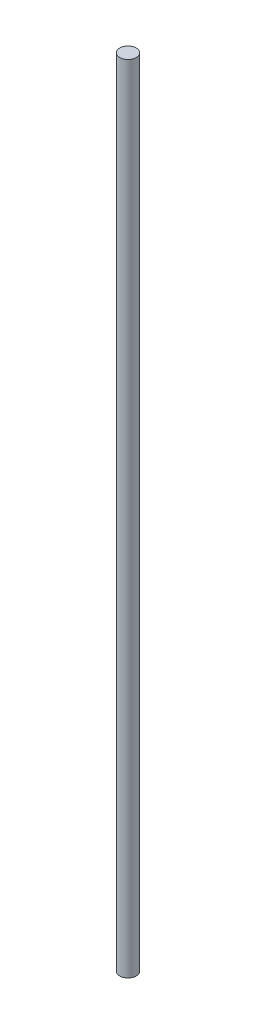
ISO-10303-21;
HEADER;
FILE_DESCRIPTION(('STEP AP214'),'2;1');
FILE_NAME('part.step','',(''),(''),'','','');
FILE_SCHEMA(('AUTOMOTIVE_DESIGN { 1 0 10303 214 1 1 1 1 }'));
ENDSEC;
DATA;
#1=APPLICATION_CONTEXT('core data for automotive mechanical design processes');
#2=APPLICATION_PROTOCOL_DEFINITION('international standard','automotive_design',2000,#1);
#3=PRODUCT_CONTEXT('',#1,'mechanical');
#4=PRODUCT('Part','Part','',(#3));
#5=PRODUCT_RELATED_PRODUCT_CATEGORY('part','',(#4));
#6=PRODUCT_DEFINITION_FORMATION('','',#4);
#7=PRODUCT_DEFINITION_CONTEXT('part definition',#1,'design');
#8=PRODUCT_DEFINITION('design','',#6,#7);
#9=PRODUCT_DEFINITION_SHAPE('','',#8);
#10=(LENGTH_UNIT() NAMED_UNIT(*) SI_UNIT(.MILLI.,.METRE.));
#11=(NAMED_UNIT(*) PLANE_ANGLE_UNIT() SI_UNIT($,.RADIAN.));
#12=(NAMED_UNIT(*) SI_UNIT($,.STERADIAN.) SOLID_ANGLE_UNIT());
#13=UNCERTAINTY_MEASURE_WITH_UNIT(LENGTH_MEASURE(1.E-05),#10,'distance_accuracy_value','');
#14=(GEOMETRIC_REPRESENTATION_CONTEXT(3) GLOBAL_UNCERTAINTY_ASSIGNED_CONTEXT((#13)) GLOBAL_UNIT_ASSIGNED_CONTEXT((#10,
#11,#12)) REPRESENTATION_CONTEXT('',''));
#15=CARTESIAN_POINT('',(0.,0.,0.));
#16=DIRECTION('',(0.,0.,1.));
#17=DIRECTION('',(1.,0.,0.));
#18=AXIS2_PLACEMENT_3D('',#15,#16,#17);
#19=CARTESIAN_POINT('',(0.,385.,0.));
#20=DIRECTION('',(0.,-1.,0.));
#21=DIRECTION('',(0.,0.,-1.));
#22=AXIS2_PLACEMENT_3D('',#19,#20,#21);
#23=CYLINDRICAL_SURFACE('',#22,4.);
#24=CARTESIAN_POINT('',(0.,385.,0.));
#25=DIRECTION('',(0.,1.,0.));
#26=DIRECTION('',(0.,0.,1.));
#27=AXIS2_PLACEMENT_3D('',#24,#25,#26);
#28=CIRCLE('',#27,4.);
#29=CARTESIAN_POINT('',(0.,385.,4.));
#30=VERTEX_POINT('',#29);
#31=EDGE_CURVE('E10',#30,#30,#28,.T.);
#32=ORIENTED_EDGE('',*,*,#31,.F.);
#33=EDGE_LOOP('',(#32));
#34=FACE_BOUND('',#33,.T.);
#35=CARTESIAN_POINT('',(0.,0.,0.));
#36=DIRECTION('',(0.,1.,0.));
#37=DIRECTION('',(0.,0.,1.));
#38=AXIS2_PLACEMENT_3D('',#35,#36,#37);
#39=CIRCLE('',#38,4.);
#40=CARTESIAN_POINT('',(0.,0.,4.));
#41=VERTEX_POINT('',#40);
#42=EDGE_CURVE('E36',#41,#41,#39,.T.);
#43=ORIENTED_EDGE('',*,*,#42,.T.);
#44=EDGE_LOOP('',(#43));
#45=FACE_BOUND('',#44,.T.);
#46=ADVANCED_FACE('F33',(#34,#45),#23,.T.);
#47=CARTESIAN_POINT('',(0.,385.,0.));
#48=DIRECTION('',(0.,1.,0.));
#49=DIRECTION('',(0.,0.,1.));
#50=AXIS2_PLACEMENT_3D('',#47,#48,#49);
#51=PLANE('',#50);
#52=ORIENTED_EDGE('',*,*,#31,.T.);
#53=EDGE_LOOP('',(#52));
#54=FACE_BOUND('',#53,.T.);
#55=ADVANCED_FACE('F48',(#54),#51,.T.);
#56=CARTESIAN_POINT('',(0.,0.,0.));
#57=DIRECTION('',(0.,1.,0.));
#58=DIRECTION('',(0.,0.,1.));
#59=AXIS2_PLACEMENT_3D('',#56,#57,#58);
#60=PLANE('',#59);
#61=ORIENTED_EDGE('',*,*,#42,.F.);
#62=EDGE_LOOP('',(#61));
#63=FACE_BOUND('',#62,.T.);
#64=ADVANCED_FACE('F46',(#63),#60,.F.);
#65=CLOSED_SHELL('',(#46,#55,#64));
#66=MANIFOLD_SOLID_BREP('B2',#65);
#67=ADVANCED_BREP_SHAPE_REPRESENTATION('',(#18,#66),#14);
#68=SHAPE_DEFINITION_REPRESENTATION(#9,#67);
ENDSEC;
END-ISO-10303-21;
